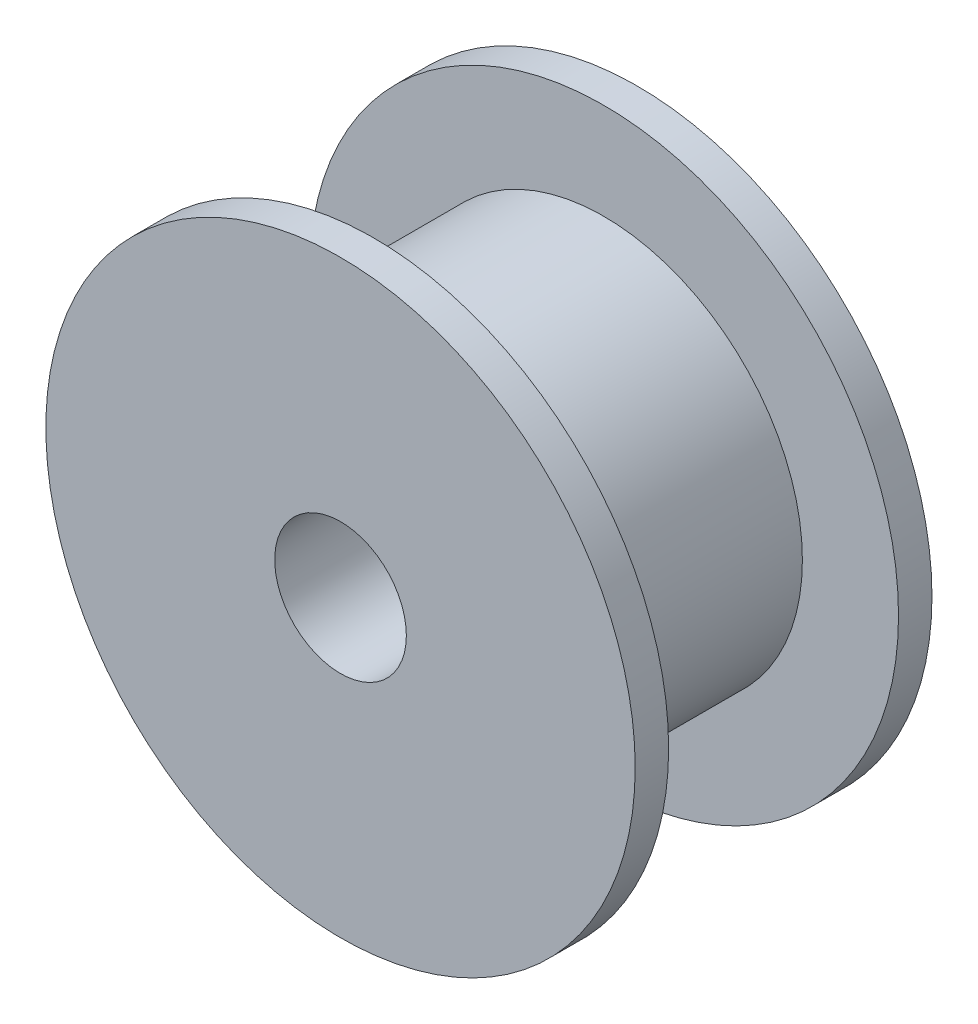
ISO-10303-21;
HEADER;
FILE_DESCRIPTION(('STEP AP214'),'2;1');
FILE_NAME('part.step','',(''),(''),'','','');
FILE_SCHEMA(('AUTOMOTIVE_DESIGN { 1 0 10303 214 1 1 1 1 }'));
ENDSEC;
DATA;
#1=APPLICATION_CONTEXT('core data for automotive mechanical design processes');
#2=APPLICATION_PROTOCOL_DEFINITION('international standard','automotive_design',2000,#1);
#3=PRODUCT_CONTEXT('',#1,'mechanical');
#4=PRODUCT('Part','Part','',(#3));
#5=PRODUCT_RELATED_PRODUCT_CATEGORY('part','',(#4));
#6=PRODUCT_DEFINITION_FORMATION('','',#4);
#7=PRODUCT_DEFINITION_CONTEXT('part definition',#1,'design');
#8=PRODUCT_DEFINITION('design','',#6,#7);
#9=PRODUCT_DEFINITION_SHAPE('','',#8);
#10=(LENGTH_UNIT() NAMED_UNIT(*) SI_UNIT(.MILLI.,.METRE.));
#11=(NAMED_UNIT(*) PLANE_ANGLE_UNIT() SI_UNIT($,.RADIAN.));
#12=(NAMED_UNIT(*) SI_UNIT($,.STERADIAN.) SOLID_ANGLE_UNIT());
#13=UNCERTAINTY_MEASURE_WITH_UNIT(LENGTH_MEASURE(1.E-05),#10,'distance_accuracy_value','');
#14=(GEOMETRIC_REPRESENTATION_CONTEXT(3) GLOBAL_UNCERTAINTY_ASSIGNED_CONTEXT((#13)) GLOBAL_UNIT_ASSIGNED_CONTEXT((#10,
#11,#12)) REPRESENTATION_CONTEXT('',''));
#15=CARTESIAN_POINT('',(0.,0.,0.));
#16=DIRECTION('',(0.,0.,1.));
#17=DIRECTION('',(1.,0.,0.));
#18=AXIS2_PLACEMENT_3D('',#15,#16,#17);
#19=CARTESIAN_POINT('',(0.,0.,1.016));
#20=DIRECTION('',(0.,0.,1.));
#21=DIRECTION('',(1.,0.,0.));
#22=AXIS2_PLACEMENT_3D('',#19,#20,#21);
#23=PLANE('',#22);
#24=CARTESIAN_POINT('',(0.,0.,1.016));
#25=DIRECTION('',(0.,0.,1.));
#26=DIRECTION('',(1.,0.,0.));
#27=AXIS2_PLACEMENT_3D('',#24,#25,#26);
#28=CIRCLE('',#27,6.0325);
#29=CARTESIAN_POINT('',(6.0325,0.,1.016));
#30=VERTEX_POINT('',#29);
#31=EDGE_CURVE('E10',#30,#30,#28,.T.);
#32=ORIENTED_EDGE('',*,*,#31,.F.);
#33=EDGE_LOOP('',(#32));
#34=FACE_BOUND('',#33,.T.);
#35=CARTESIAN_POINT('',(0.,0.,1.016));
#36=DIRECTION('',(0.,0.,1.));
#37=DIRECTION('',(1.,0.,0.));
#38=AXIS2_PLACEMENT_3D('',#35,#36,#37);
#39=CIRCLE('',#38,8.9535);
#40=CARTESIAN_POINT('',(8.9535,0.,1.016));
#41=VERTEX_POINT('',#40);
#42=EDGE_CURVE('E39',#41,#41,#39,.T.);
#43=ORIENTED_EDGE('',*,*,#42,.T.);
#44=EDGE_LOOP('',(#43));
#45=FACE_BOUND('',#44,.T.);
#46=ADVANCED_FACE('F31',(#34,#45),#23,.T.);
#47=CARTESIAN_POINT('',(0.,0.,0.));
#48=DIRECTION('',(0.,0.,1.));
#49=DIRECTION('',(1.,0.,0.));
#50=AXIS2_PLACEMENT_3D('',#47,#48,#49);
#51=PLANE('',#50);
#52=CARTESIAN_POINT('',(0.,0.,0.));
#53=DIRECTION('',(0.,0.,1.));
#54=DIRECTION('',(1.,0.,0.));
#55=AXIS2_PLACEMENT_3D('',#52,#53,#54);
#56=CIRCLE('',#55,8.9535);
#57=CARTESIAN_POINT('',(8.9535,0.,0.));
#58=VERTEX_POINT('',#57);
#59=EDGE_CURVE('E35',#58,#58,#56,.T.);
#60=ORIENTED_EDGE('',*,*,#59,.F.);
#61=EDGE_LOOP('',(#60));
#62=FACE_BOUND('',#61,.T.);
#63=CARTESIAN_POINT('',(0.,0.,0.));
#64=DIRECTION('',(0.,0.,1.));
#65=DIRECTION('',(1.,0.,0.));
#66=AXIS2_PLACEMENT_3D('',#63,#64,#65);
#67=CIRCLE('',#66,2.);
#68=CARTESIAN_POINT('',(2.,0.,0.));
#69=VERTEX_POINT('',#68);
#70=EDGE_CURVE('E48',#69,#69,#67,.T.);
#71=ORIENTED_EDGE('',*,*,#70,.T.);
#72=EDGE_LOOP('',(#71));
#73=FACE_BOUND('',#72,.T.);
#74=ADVANCED_FACE('F84',(#62,#73),#51,.F.);
#75=CARTESIAN_POINT('',(0.,0.,1.016));
#76=DIRECTION('',(0.,0.,-1.));
#77=DIRECTION('',(-1.,0.,0.));
#78=AXIS2_PLACEMENT_3D('',#75,#76,#77);
#79=CYLINDRICAL_SURFACE('',#78,8.9535);
#80=ORIENTED_EDGE('',*,*,#42,.F.);
#81=EDGE_LOOP('',(#80));
#82=FACE_BOUND('',#81,.T.);
#83=ORIENTED_EDGE('',*,*,#59,.T.);
#84=EDGE_LOOP('',(#83));
#85=FACE_BOUND('',#84,.T.);
#86=ADVANCED_FACE('F33',(#82,#85),#79,.T.);
#87=CARTESIAN_POINT('',(0.,0.,1.016));
#88=DIRECTION('',(0.,0.,-1.));
#89=DIRECTION('',(-1.,0.,0.));
#90=AXIS2_PLACEMENT_3D('',#87,#88,#89);
#91=CYLINDRICAL_SURFACE('',#90,2.);
#92=ORIENTED_EDGE('',*,*,#70,.F.);
#93=EDGE_LOOP('',(#92));
#94=FACE_BOUND('',#93,.T.);
#95=CARTESIAN_POINT('',(0.,0.,9.017));
#96=DIRECTION('',(0.,0.,1.));
#97=DIRECTION('',(1.,0.,0.));
#98=AXIS2_PLACEMENT_3D('',#95,#96,#97);
#99=CIRCLE('',#98,2.);
#100=CARTESIAN_POINT('',(2.,0.,9.017));
#101=VERTEX_POINT('',#100);
#102=EDGE_CURVE('E63',#101,#101,#99,.T.);
#103=ORIENTED_EDGE('',*,*,#102,.T.);
#104=EDGE_LOOP('',(#103));
#105=FACE_BOUND('',#104,.T.);
#106=ADVANCED_FACE('F68',(#94,#105),#91,.F.);
#107=CARTESIAN_POINT('',(0.,0.,8.001));
#108=DIRECTION('',(0.,0.,-1.));
#109=DIRECTION('',(-1.,0.,0.));
#110=AXIS2_PLACEMENT_3D('',#107,#108,#109);
#111=CYLINDRICAL_SURFACE('',#110,6.0325);
#112=CARTESIAN_POINT('',(0.,0.,8.001));
#113=DIRECTION('',(0.,0.,1.));
#114=DIRECTION('',(1.,0.,0.));
#115=AXIS2_PLACEMENT_3D('',#112,#113,#114);
#116=CIRCLE('',#115,6.0325);
#117=CARTESIAN_POINT('',(6.0325,0.,8.001));
#118=VERTEX_POINT('',#117);
#119=EDGE_CURVE('E46',#118,#118,#116,.T.);
#120=ORIENTED_EDGE('',*,*,#119,.F.);
#121=EDGE_LOOP('',(#120));
#122=FACE_BOUND('',#121,.T.);
#123=ORIENTED_EDGE('',*,*,#31,.T.);
#124=EDGE_LOOP('',(#123));
#125=FACE_BOUND('',#124,.T.);
#126=ADVANCED_FACE('F73',(#122,#125),#111,.T.);
#127=CARTESIAN_POINT('',(0.,0.,9.017));
#128=DIRECTION('',(0.,0.,1.));
#129=DIRECTION('',(1.,0.,0.));
#130=AXIS2_PLACEMENT_3D('',#127,#128,#129);
#131=PLANE('',#130);
#132=CARTESIAN_POINT('',(0.,0.,9.017));
#133=DIRECTION('',(0.,0.,1.));
#134=DIRECTION('',(1.,0.,0.));
#135=AXIS2_PLACEMENT_3D('',#132,#133,#134);
#136=CIRCLE('',#135,8.9535);
#137=CARTESIAN_POINT('',(8.9535,0.,9.017));
#138=VERTEX_POINT('',#137);
#139=EDGE_CURVE('E54',#138,#138,#136,.T.);
#140=ORIENTED_EDGE('',*,*,#139,.T.);
#141=EDGE_LOOP('',(#140));
#142=FACE_BOUND('',#141,.T.);
#143=ORIENTED_EDGE('',*,*,#102,.F.);
#144=EDGE_LOOP('',(#143));
#145=FACE_BOUND('',#144,.T.);
#146=ADVANCED_FACE('F70',(#142,#145),#131,.T.);
#147=CARTESIAN_POINT('',(0.,0.,8.001));
#148=DIRECTION('',(0.,0.,1.));
#149=DIRECTION('',(1.,0.,0.));
#150=AXIS2_PLACEMENT_3D('',#147,#148,#149);
#151=PLANE('',#150);
#152=ORIENTED_EDGE('',*,*,#119,.T.);
#153=EDGE_LOOP('',(#152));
#154=FACE_BOUND('',#153,.T.);
#155=CARTESIAN_POINT('',(0.,0.,8.001));
#156=DIRECTION('',(0.,0.,1.));
#157=DIRECTION('',(1.,0.,0.));
#158=AXIS2_PLACEMENT_3D('',#155,#156,#157);
#159=CIRCLE('',#158,8.9535);
#160=CARTESIAN_POINT('',(8.9535,0.,8.001));
#161=VERTEX_POINT('',#160);
#162=EDGE_CURVE('E58',#161,#161,#159,.T.);
#163=ORIENTED_EDGE('',*,*,#162,.F.);
#164=EDGE_LOOP('',(#163));
#165=FACE_BOUND('',#164,.T.);
#166=ADVANCED_FACE('F72',(#154,#165),#151,.F.);
#167=CARTESIAN_POINT('',(0.,0.,9.017));
#168=DIRECTION('',(0.,0.,-1.));
#169=DIRECTION('',(-1.,0.,0.));
#170=AXIS2_PLACEMENT_3D('',#167,#168,#169);
#171=CYLINDRICAL_SURFACE('',#170,8.9535);
#172=ORIENTED_EDGE('',*,*,#139,.F.);
#173=EDGE_LOOP('',(#172));
#174=FACE_BOUND('',#173,.T.);
#175=ORIENTED_EDGE('',*,*,#162,.T.);
#176=EDGE_LOOP('',(#175));
#177=FACE_BOUND('',#176,.T.);
#178=ADVANCED_FACE('F79',(#174,#177),#171,.T.);
#179=CLOSED_SHELL('',(#46,#74,#86,#106,#126,#146,#166,#178));
#180=MANIFOLD_SOLID_BREP('B2',#179);
#181=ADVANCED_BREP_SHAPE_REPRESENTATION('',(#18,#180),#14);
#182=SHAPE_DEFINITION_REPRESENTATION(#9,#181);
ENDSEC;
END-ISO-10303-21;
